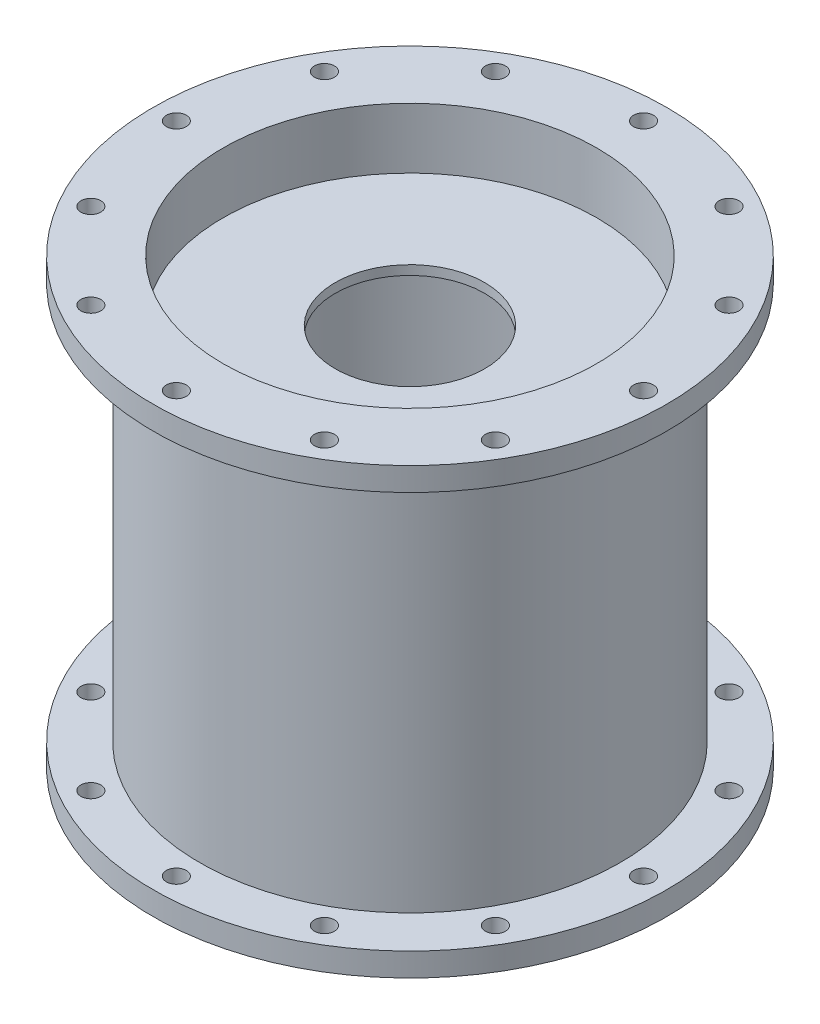
ISO-10303-21;
HEADER;
FILE_DESCRIPTION(('STEP AP214'),'2;1');
FILE_NAME('part.step','',(''),(''),'','','');
FILE_SCHEMA(('AUTOMOTIVE_DESIGN { 1 0 10303 214 1 1 1 1 }'));
ENDSEC;
DATA;
#1=APPLICATION_CONTEXT('core data for automotive mechanical design processes');
#2=APPLICATION_PROTOCOL_DEFINITION('international standard','automotive_design',2000,#1);
#3=PRODUCT_CONTEXT('',#1,'mechanical');
#4=PRODUCT('Part','Part','',(#3));
#5=PRODUCT_RELATED_PRODUCT_CATEGORY('part','',(#4));
#6=PRODUCT_DEFINITION_FORMATION('','',#4);
#7=PRODUCT_DEFINITION_CONTEXT('part definition',#1,'design');
#8=PRODUCT_DEFINITION('design','',#6,#7);
#9=PRODUCT_DEFINITION_SHAPE('','',#8);
#10=(LENGTH_UNIT() NAMED_UNIT(*) SI_UNIT(.MILLI.,.METRE.));
#11=(NAMED_UNIT(*) PLANE_ANGLE_UNIT() SI_UNIT($,.RADIAN.));
#12=(NAMED_UNIT(*) SI_UNIT($,.STERADIAN.) SOLID_ANGLE_UNIT());
#13=UNCERTAINTY_MEASURE_WITH_UNIT(LENGTH_MEASURE(1.E-05),#10,'distance_accuracy_value','');
#14=(GEOMETRIC_REPRESENTATION_CONTEXT(3) GLOBAL_UNCERTAINTY_ASSIGNED_CONTEXT((#13)) GLOBAL_UNIT_ASSIGNED_CONTEXT((#10,
#11,#12)) REPRESENTATION_CONTEXT('',''));
#15=CARTESIAN_POINT('',(0.,0.,0.));
#16=DIRECTION('',(0.,0.,1.));
#17=DIRECTION('',(1.,0.,0.));
#18=AXIS2_PLACEMENT_3D('',#15,#16,#17);
#19=CARTESIAN_POINT('',(0.,0.,0.));
#20=DIRECTION('',(0.,-1.,0.));
#21=DIRECTION('',(0.,0.,-1.));
#22=AXIS2_PLACEMENT_3D('',#19,#20,#21);
#23=CYLINDRICAL_SURFACE('',#22,50.8);
#24=CARTESIAN_POINT('',(0.,101.661657822041,0.));
#25=DIRECTION('',(0.,-1.,0.));
#26=DIRECTION('',(0.,0.,-1.));
#27=AXIS2_PLACEMENT_3D('',#24,#25,#26);
#28=CIRCLE('',#27,50.8);
#29=CARTESIAN_POINT('',(0.,101.661657822041,-50.8));
#30=VERTEX_POINT('',#29);
#31=EDGE_CURVE('E10',#30,#30,#28,.T.);
#32=ORIENTED_EDGE('',*,*,#31,.F.);
#33=EDGE_LOOP('',(#32));
#34=FACE_BOUND('',#33,.T.);
#35=CARTESIAN_POINT('',(0.,18.9883421779588,0.));
#36=DIRECTION('',(0.,1.,0.));
#37=DIRECTION('',(0.,0.,1.));
#38=AXIS2_PLACEMENT_3D('',#35,#36,#37);
#39=CIRCLE('',#38,50.8);
#40=CARTESIAN_POINT('',(0.,18.9883421779588,50.8));
#41=VERTEX_POINT('',#40);
#42=EDGE_CURVE('E58',#41,#41,#39,.T.);
#43=ORIENTED_EDGE('',*,*,#42,.F.);
#44=EDGE_LOOP('',(#43));
#45=FACE_BOUND('',#44,.T.);
#46=ADVANCED_FACE('F43',(#34,#45),#23,.F.);
#47=CARTESIAN_POINT('',(0.,104.201657822041,0.));
#48=DIRECTION('',(0.,1.,0.));
#49=DIRECTION('',(0.,0.,1.));
#50=AXIS2_PLACEMENT_3D('',#47,#48,#49);
#51=CIRCLE('',#50,50.8);
#52=CARTESIAN_POINT('',(0.,104.201657822041,50.8));
#53=VERTEX_POINT('',#52);
#54=EDGE_CURVE('E52',#53,#53,#51,.T.);
#55=ORIENTED_EDGE('',*,*,#54,.F.);
#56=EDGE_LOOP('',(#55));
#57=FACE_BOUND('',#56,.T.);
#58=CARTESIAN_POINT('',(0.,120.65,0.));
#59=DIRECTION('',(0.,-1.,0.));
#60=DIRECTION('',(0.,0.,-1.));
#61=AXIS2_PLACEMENT_3D('',#58,#59,#60);
#62=CIRCLE('',#61,50.8);
#63=CARTESIAN_POINT('',(0.,120.65,-50.8));
#64=VERTEX_POINT('',#63);
#65=EDGE_CURVE('E167',#64,#64,#62,.T.);
#66=ORIENTED_EDGE('',*,*,#65,.F.);
#67=EDGE_LOOP('',(#66));
#68=FACE_BOUND('',#67,.T.);
#69=ADVANCED_FACE('F205',(#57,#68),#23,.F.);
#70=CARTESIAN_POINT('',(0.,0.,-57.15));
#71=DIRECTION('',(0.,-1.,0.));
#72=DIRECTION('',(0.,0.,-1.));
#73=AXIS2_PLACEMENT_3D('',#70,#71,#72);
#74=PLANE('',#73);
#75=CARTESIAN_POINT('',(-63.5,0.,0.));
#76=DIRECTION('',(0.,1.,0.));
#77=DIRECTION('',(0.,0.,1.));
#78=AXIS2_PLACEMENT_3D('',#75,#76,#77);
#79=CIRCLE('',#78,2.70509999999999);
#80=CARTESIAN_POINT('',(-63.5,0.,2.70509999999998));
#81=VERTEX_POINT('',#80);
#82=EDGE_CURVE('E244',#81,#81,#79,.T.);
#83=ORIENTED_EDGE('',*,*,#82,.T.);
#84=EDGE_LOOP('',(#83));
#85=FACE_BOUND('',#84,.T.);
#86=CARTESIAN_POINT('',(-54.9926131403119,0.,-31.75));
#87=DIRECTION('',(0.,1.,0.));
#88=DIRECTION('',(0.,0.,1.));
#89=AXIS2_PLACEMENT_3D('',#86,#87,#88);
#90=CIRCLE('',#89,2.70509999999999);
#91=CARTESIAN_POINT('',(-54.9926131403119,0.,-29.0449));
#92=VERTEX_POINT('',#91);
#93=EDGE_CURVE('E248',#92,#92,#90,.T.);
#94=ORIENTED_EDGE('',*,*,#93,.T.);
#95=EDGE_LOOP('',(#94));
#96=FACE_BOUND('',#95,.T.);
#97=CARTESIAN_POINT('',(-31.75,0.,-54.9926131403119));
#98=DIRECTION('',(0.,1.,0.));
#99=DIRECTION('',(0.,0.,1.));
#100=AXIS2_PLACEMENT_3D('',#97,#98,#99);
#101=CIRCLE('',#100,2.70509999999998);
#102=CARTESIAN_POINT('',(-31.75,0.,-52.2875131403119));
#103=VERTEX_POINT('',#102);
#104=EDGE_CURVE('E252',#103,#103,#101,.T.);
#105=ORIENTED_EDGE('',*,*,#104,.T.);
#106=EDGE_LOOP('',(#105));
#107=FACE_BOUND('',#106,.T.);
#108=CARTESIAN_POINT('',(0.,0.,-63.5));
#109=DIRECTION('',(0.,1.,0.));
#110=DIRECTION('',(0.,0.,1.));
#111=AXIS2_PLACEMENT_3D('',#108,#109,#110);
#112=CIRCLE('',#111,2.70509999999999);
#113=CARTESIAN_POINT('',(0.,0.,-60.7949));
#114=VERTEX_POINT('',#113);
#115=EDGE_CURVE('E256',#114,#114,#112,.T.);
#116=ORIENTED_EDGE('',*,*,#115,.T.);
#117=EDGE_LOOP('',(#116));
#118=FACE_BOUND('',#117,.T.);
#119=CARTESIAN_POINT('',(31.75,0.,-54.9926131403119));
#120=DIRECTION('',(0.,1.,0.));
#121=DIRECTION('',(0.,0.,1.));
#122=AXIS2_PLACEMENT_3D('',#119,#120,#121);
#123=CIRCLE('',#122,2.70509999999999);
#124=CARTESIAN_POINT('',(31.75,0.,-52.2875131403119));
#125=VERTEX_POINT('',#124);
#126=EDGE_CURVE('E260',#125,#125,#123,.T.);
#127=ORIENTED_EDGE('',*,*,#126,.T.);
#128=EDGE_LOOP('',(#127));
#129=FACE_BOUND('',#128,.T.);
#130=CARTESIAN_POINT('',(54.9926131403119,0.,-31.75));
#131=DIRECTION('',(0.,1.,0.));
#132=DIRECTION('',(0.,0.,1.));
#133=AXIS2_PLACEMENT_3D('',#130,#131,#132);
#134=CIRCLE('',#133,2.70509999999999);
#135=CARTESIAN_POINT('',(54.9926131403119,0.,-29.0449));
#136=VERTEX_POINT('',#135);
#137=EDGE_CURVE('E264',#136,#136,#134,.T.);
#138=ORIENTED_EDGE('',*,*,#137,.T.);
#139=EDGE_LOOP('',(#138));
#140=FACE_BOUND('',#139,.T.);
#141=CARTESIAN_POINT('',(63.5,0.,0.));
#142=DIRECTION('',(0.,1.,0.));
#143=DIRECTION('',(0.,0.,1.));
#144=AXIS2_PLACEMENT_3D('',#141,#142,#143);
#145=CIRCLE('',#144,2.70509999999999);
#146=CARTESIAN_POINT('',(63.5,0.,2.70509999999999));
#147=VERTEX_POINT('',#146);
#148=EDGE_CURVE('E267',#147,#147,#145,.T.);
#149=ORIENTED_EDGE('',*,*,#148,.T.);
#150=EDGE_LOOP('',(#149));
#151=FACE_BOUND('',#150,.T.);
#152=CARTESIAN_POINT('',(54.9926131403119,0.,31.75));
#153=DIRECTION('',(0.,1.,0.));
#154=DIRECTION('',(0.,0.,1.));
#155=AXIS2_PLACEMENT_3D('',#152,#153,#154);
#156=CIRCLE('',#155,2.70509999999999);
#157=CARTESIAN_POINT('',(54.9926131403119,0.,34.4551));
#158=VERTEX_POINT('',#157);
#159=EDGE_CURVE('E77',#158,#158,#156,.T.);
#160=ORIENTED_EDGE('',*,*,#159,.T.);
#161=EDGE_LOOP('',(#160));
#162=FACE_BOUND('',#161,.T.);
#163=CARTESIAN_POINT('',(31.75,0.,54.9926131403119));
#164=DIRECTION('',(0.,1.,0.));
#165=DIRECTION('',(0.,0.,1.));
#166=AXIS2_PLACEMENT_3D('',#163,#164,#165);
#167=CIRCLE('',#166,2.70509999999999);
#168=CARTESIAN_POINT('',(31.75,0.,57.6977131403118));
#169=VERTEX_POINT('',#168);
#170=EDGE_CURVE('E99',#169,#169,#167,.T.);
#171=ORIENTED_EDGE('',*,*,#170,.T.);
#172=EDGE_LOOP('',(#171));
#173=FACE_BOUND('',#172,.T.);
#174=CARTESIAN_POINT('',(0.,0.,63.5));
#175=DIRECTION('',(0.,1.,0.));
#176=DIRECTION('',(0.,0.,1.));
#177=AXIS2_PLACEMENT_3D('',#174,#175,#176);
#178=CIRCLE('',#177,2.70509999999999);
#179=CARTESIAN_POINT('',(0.,0.,66.2051));
#180=VERTEX_POINT('',#179);
#181=EDGE_CURVE('E115',#180,#180,#178,.T.);
#182=ORIENTED_EDGE('',*,*,#181,.T.);
#183=EDGE_LOOP('',(#182));
#184=FACE_BOUND('',#183,.T.);
#185=CARTESIAN_POINT('',(-31.75,0.,54.9926131403119));
#186=DIRECTION('',(0.,1.,0.));
#187=DIRECTION('',(0.,0.,1.));
#188=AXIS2_PLACEMENT_3D('',#185,#186,#187);
#189=CIRCLE('',#188,2.70509999999998);
#190=CARTESIAN_POINT('',(-31.75,0.,57.6977131403119));
#191=VERTEX_POINT('',#190);
#192=EDGE_CURVE('E72',#191,#191,#189,.T.);
#193=ORIENTED_EDGE('',*,*,#192,.T.);
#194=EDGE_LOOP('',(#193));
#195=FACE_BOUND('',#194,.T.);
#196=CARTESIAN_POINT('',(-54.9926131403119,0.,31.75));
#197=DIRECTION('',(0.,1.,0.));
#198=DIRECTION('',(0.,0.,1.));
#199=AXIS2_PLACEMENT_3D('',#196,#197,#198);
#200=CIRCLE('',#199,2.70509999999999);
#201=CARTESIAN_POINT('',(-54.9926131403119,0.,34.4551));
#202=VERTEX_POINT('',#201);
#203=EDGE_CURVE('E67',#202,#202,#200,.T.);
#204=ORIENTED_EDGE('',*,*,#203,.T.);
#205=EDGE_LOOP('',(#204));
#206=FACE_BOUND('',#205,.T.);
#207=CARTESIAN_POINT('',(0.,0.,0.));
#208=DIRECTION('',(0.,-1.,0.));
#209=DIRECTION('',(0.,0.,-1.));
#210=AXIS2_PLACEMENT_3D('',#207,#208,#209);
#211=CIRCLE('',#210,69.85);
#212=CARTESIAN_POINT('',(0.,0.,-69.85));
#213=VERTEX_POINT('',#212);
#214=EDGE_CURVE('E191',#213,#213,#211,.T.);
#215=ORIENTED_EDGE('',*,*,#214,.T.);
#216=EDGE_LOOP('',(#215));
#217=FACE_BOUND('',#216,.T.);
#218=CARTESIAN_POINT('',(0.,0.,0.));
#219=DIRECTION('',(0.,-1.,0.));
#220=DIRECTION('',(0.,0.,-1.));
#221=AXIS2_PLACEMENT_3D('',#218,#219,#220);
#222=CIRCLE('',#221,50.8);
#223=CARTESIAN_POINT('',(0.,0.,-50.8));
#224=VERTEX_POINT('',#223);
#225=EDGE_CURVE('E163',#224,#224,#222,.T.);
#226=ORIENTED_EDGE('',*,*,#225,.F.);
#227=EDGE_LOOP('',(#226));
#228=FACE_BOUND('',#227,.T.);
#229=ADVANCED_FACE('F45',(#85,#96,#107,#118,#129,#140,#151,#162,#173,#184,#195,#206,#217,#228),
#74,.T.);
#230=CARTESIAN_POINT('',(0.,0.,0.));
#231=DIRECTION('',(0.,-1.,0.));
#232=DIRECTION('',(0.,0.,-1.));
#233=AXIS2_PLACEMENT_3D('',#230,#231,#232);
#234=CYLINDRICAL_SURFACE('',#233,69.85);
#235=CARTESIAN_POINT('',(0.,6.35,0.));
#236=DIRECTION('',(0.,-1.,0.));
#237=DIRECTION('',(0.,0.,-1.));
#238=AXIS2_PLACEMENT_3D('',#235,#236,#237);
#239=CIRCLE('',#238,69.85);
#240=CARTESIAN_POINT('',(0.,6.35,-69.85));
#241=VERTEX_POINT('',#240);
#242=EDGE_CURVE('E187',#241,#241,#239,.T.);
#243=ORIENTED_EDGE('',*,*,#242,.T.);
#244=EDGE_LOOP('',(#243));
#245=FACE_BOUND('',#244,.T.);
#246=ORIENTED_EDGE('',*,*,#214,.F.);
#247=EDGE_LOOP('',(#246));
#248=FACE_BOUND('',#247,.T.);
#249=ADVANCED_FACE('F232',(#245,#248),#234,.T.);
#250=CARTESIAN_POINT('',(0.,6.35,-69.85));
#251=DIRECTION('',(0.,1.,0.));
#252=DIRECTION('',(0.,0.,1.));
#253=AXIS2_PLACEMENT_3D('',#250,#251,#252);
#254=PLANE('',#253);
#255=CARTESIAN_POINT('',(-63.5,6.34999999999999,0.));
#256=DIRECTION('',(0.,1.,0.));
#257=DIRECTION('',(0.,0.,1.));
#258=AXIS2_PLACEMENT_3D('',#255,#256,#257);
#259=CIRCLE('',#258,2.70509999999999);
#260=CARTESIAN_POINT('',(-63.5,6.34999999999999,2.70509999999998));
#261=VERTEX_POINT('',#260);
#262=EDGE_CURVE('E559',#261,#261,#259,.T.);
#263=ORIENTED_EDGE('',*,*,#262,.F.);
#264=EDGE_LOOP('',(#263));
#265=FACE_BOUND('',#264,.T.);
#266=CARTESIAN_POINT('',(-54.9926131403119,6.34999999999999,-31.75));
#267=DIRECTION('',(0.,1.,0.));
#268=DIRECTION('',(0.,0.,1.));
#269=AXIS2_PLACEMENT_3D('',#266,#267,#268);
#270=CIRCLE('',#269,2.70509999999999);
#271=CARTESIAN_POINT('',(-54.9926131403119,6.34999999999999,-29.0449));
#272=VERTEX_POINT('',#271);
#273=EDGE_CURVE('E583',#272,#272,#270,.T.);
#274=ORIENTED_EDGE('',*,*,#273,.F.);
#275=EDGE_LOOP('',(#274));
#276=FACE_BOUND('',#275,.T.);
#277=CARTESIAN_POINT('',(-31.75,6.34999999999999,-54.9926131403119));
#278=DIRECTION('',(0.,1.,0.));
#279=DIRECTION('',(0.,0.,1.));
#280=AXIS2_PLACEMENT_3D('',#277,#278,#279);
#281=CIRCLE('',#280,2.70509999999999);
#282=CARTESIAN_POINT('',(-31.75,6.34999999999999,-52.2875131403119));
#283=VERTEX_POINT('',#282);
#284=EDGE_CURVE('E597',#283,#283,#281,.T.);
#285=ORIENTED_EDGE('',*,*,#284,.F.);
#286=EDGE_LOOP('',(#285));
#287=FACE_BOUND('',#286,.T.);
#288=CARTESIAN_POINT('',(0.,6.34999999999999,-63.5));
#289=DIRECTION('',(0.,1.,0.));
#290=DIRECTION('',(0.,0.,1.));
#291=AXIS2_PLACEMENT_3D('',#288,#289,#290);
#292=CIRCLE('',#291,2.70509999999999);
#293=CARTESIAN_POINT('',(0.,6.34999999999999,-60.7949));
#294=VERTEX_POINT('',#293);
#295=EDGE_CURVE('E607',#294,#294,#292,.T.);
#296=ORIENTED_EDGE('',*,*,#295,.F.);
#297=EDGE_LOOP('',(#296));
#298=FACE_BOUND('',#297,.T.);
#299=CARTESIAN_POINT('',(31.75,6.34999999999999,-54.9926131403119));
#300=DIRECTION('',(0.,1.,0.));
#301=DIRECTION('',(0.,0.,1.));
#302=AXIS2_PLACEMENT_3D('',#299,#300,#301);
#303=CIRCLE('',#302,2.70509999999999);
#304=CARTESIAN_POINT('',(31.75,6.34999999999999,-52.2875131403119));
#305=VERTEX_POINT('',#304);
#306=EDGE_CURVE('E621',#305,#305,#303,.T.);
#307=ORIENTED_EDGE('',*,*,#306,.F.);
#308=EDGE_LOOP('',(#307));
#309=FACE_BOUND('',#308,.T.);
#310=CARTESIAN_POINT('',(54.9926131403119,6.34999999999999,-31.75));
#311=DIRECTION('',(0.,1.,0.));
#312=DIRECTION('',(0.,0.,1.));
#313=AXIS2_PLACEMENT_3D('',#310,#311,#312);
#314=CIRCLE('',#313,2.70509999999999);
#315=CARTESIAN_POINT('',(54.9926131403119,6.34999999999999,-29.0449));
#316=VERTEX_POINT('',#315);
#317=EDGE_CURVE('E635',#316,#316,#314,.T.);
#318=ORIENTED_EDGE('',*,*,#317,.F.);
#319=EDGE_LOOP('',(#318));
#320=FACE_BOUND('',#319,.T.);
#321=CARTESIAN_POINT('',(63.5,6.34999999999999,0.));
#322=DIRECTION('',(0.,1.,0.));
#323=DIRECTION('',(0.,0.,1.));
#324=AXIS2_PLACEMENT_3D('',#321,#322,#323);
#325=CIRCLE('',#324,2.70509999999999);
#326=CARTESIAN_POINT('',(63.5,6.34999999999999,2.70509999999999));
#327=VERTEX_POINT('',#326);
#328=EDGE_CURVE('E92',#327,#327,#325,.T.);
#329=ORIENTED_EDGE('',*,*,#328,.F.);
#330=EDGE_LOOP('',(#329));
#331=FACE_BOUND('',#330,.T.);
#332=CARTESIAN_POINT('',(54.9926131403119,6.34999999999999,31.75));
#333=DIRECTION('',(0.,1.,0.));
#334=DIRECTION('',(0.,0.,1.));
#335=AXIS2_PLACEMENT_3D('',#332,#333,#334);
#336=CIRCLE('',#335,2.70509999999999);
#337=CARTESIAN_POINT('',(54.9926131403119,6.34999999999999,34.4551));
#338=VERTEX_POINT('',#337);
#339=EDGE_CURVE('E73',#338,#338,#336,.T.);
#340=ORIENTED_EDGE('',*,*,#339,.F.);
#341=EDGE_LOOP('',(#340));
#342=FACE_BOUND('',#341,.T.);
#343=CARTESIAN_POINT('',(31.75,6.34999999999999,54.9926131403119));
#344=DIRECTION('',(0.,1.,0.));
#345=DIRECTION('',(0.,0.,1.));
#346=AXIS2_PLACEMENT_3D('',#343,#344,#345);
#347=CIRCLE('',#346,2.70509999999999);
#348=CARTESIAN_POINT('',(31.75,6.34999999999999,57.6977131403118));
#349=VERTEX_POINT('',#348);
#350=EDGE_CURVE('E107',#349,#349,#347,.T.);
#351=ORIENTED_EDGE('',*,*,#350,.F.);
#352=EDGE_LOOP('',(#351));
#353=FACE_BOUND('',#352,.T.);
#354=CARTESIAN_POINT('',(0.,6.34999999999999,63.5));
#355=DIRECTION('',(0.,1.,0.));
#356=DIRECTION('',(0.,0.,1.));
#357=AXIS2_PLACEMENT_3D('',#354,#355,#356);
#358=CIRCLE('',#357,2.70509999999999);
#359=CARTESIAN_POINT('',(0.,6.34999999999999,66.2051));
#360=VERTEX_POINT('',#359);
#361=EDGE_CURVE('E123',#360,#360,#358,.T.);
#362=ORIENTED_EDGE('',*,*,#361,.F.);
#363=EDGE_LOOP('',(#362));
#364=FACE_BOUND('',#363,.T.);
#365=CARTESIAN_POINT('',(-31.75,6.34999999999999,54.9926131403119));
#366=DIRECTION('',(0.,1.,0.));
#367=DIRECTION('',(0.,0.,1.));
#368=AXIS2_PLACEMENT_3D('',#365,#366,#367);
#369=CIRCLE('',#368,2.70509999999999);
#370=CARTESIAN_POINT('',(-31.75,6.34999999999999,57.6977131403119));
#371=VERTEX_POINT('',#370);
#372=EDGE_CURVE('E71',#371,#371,#369,.T.);
#373=ORIENTED_EDGE('',*,*,#372,.F.);
#374=EDGE_LOOP('',(#373));
#375=FACE_BOUND('',#374,.T.);
#376=CARTESIAN_POINT('',(-54.9926131403119,6.34999999999999,31.75));
#377=DIRECTION('',(0.,1.,0.));
#378=DIRECTION('',(0.,0.,1.));
#379=AXIS2_PLACEMENT_3D('',#376,#377,#378);
#380=CIRCLE('',#379,2.70509999999999);
#381=CARTESIAN_POINT('',(-54.9926131403119,6.34999999999999,34.4551));
#382=VERTEX_POINT('',#381);
#383=EDGE_CURVE('E62',#382,#382,#380,.T.);
#384=ORIENTED_EDGE('',*,*,#383,.F.);
#385=EDGE_LOOP('',(#384));
#386=FACE_BOUND('',#385,.T.);
#387=CARTESIAN_POINT('',(0.,6.35,0.));
#388=DIRECTION('',(0.,-1.,0.));
#389=DIRECTION('',(0.,0.,-1.));
#390=AXIS2_PLACEMENT_3D('',#387,#388,#389);
#391=CIRCLE('',#390,57.15);
#392=CARTESIAN_POINT('',(0.,6.35,-57.15));
#393=VERTEX_POINT('',#392);
#394=EDGE_CURVE('E183',#393,#393,#391,.T.);
#395=ORIENTED_EDGE('',*,*,#394,.T.);
#396=EDGE_LOOP('',(#395));
#397=FACE_BOUND('',#396,.T.);
#398=ORIENTED_EDGE('',*,*,#242,.F.);
#399=EDGE_LOOP('',(#398));
#400=FACE_BOUND('',#399,.T.);
#401=ADVANCED_FACE('F239',(#265,#276,#287,#298,#309,#320,#331,#342,#353,#364,#375,#386,#397,
#400),#254,.T.);
#402=CARTESIAN_POINT('',(0.,0.,0.));
#403=DIRECTION('',(0.,-1.,0.));
#404=DIRECTION('',(0.,0.,-1.));
#405=AXIS2_PLACEMENT_3D('',#402,#403,#404);
#406=CYLINDRICAL_SURFACE('',#405,57.15);
#407=CARTESIAN_POINT('',(0.,114.3,0.));
#408=DIRECTION('',(0.,-1.,0.));
#409=DIRECTION('',(0.,0.,-1.));
#410=AXIS2_PLACEMENT_3D('',#407,#408,#409);
#411=CIRCLE('',#410,57.15);
#412=CARTESIAN_POINT('',(0.,114.3,-57.15));
#413=VERTEX_POINT('',#412);
#414=EDGE_CURVE('E179',#413,#413,#411,.T.);
#415=ORIENTED_EDGE('',*,*,#414,.T.);
#416=EDGE_LOOP('',(#415));
#417=FACE_BOUND('',#416,.T.);
#418=ORIENTED_EDGE('',*,*,#394,.F.);
#419=EDGE_LOOP('',(#418));
#420=FACE_BOUND('',#419,.T.);
#421=ADVANCED_FACE('F659',(#417,#420),#406,.T.);
#422=CARTESIAN_POINT('',(0.,114.3,-69.85));
#423=DIRECTION('',(0.,-1.,0.));
#424=DIRECTION('',(0.,0.,-1.));
#425=AXIS2_PLACEMENT_3D('',#422,#423,#424);
#426=PLANE('',#425);
#427=CARTESIAN_POINT('',(-63.5,114.3,0.));
#428=DIRECTION('',(0.,-1.,0.));
#429=DIRECTION('',(0.,0.,-1.));
#430=AXIS2_PLACEMENT_3D('',#427,#428,#429);
#431=CIRCLE('',#430,2.70509999999999);
#432=CARTESIAN_POINT('',(-63.5,114.3,-2.70509999999999));
#433=VERTEX_POINT('',#432);
#434=EDGE_CURVE('E561',#433,#433,#431,.T.);
#435=ORIENTED_EDGE('',*,*,#434,.F.);
#436=EDGE_LOOP('',(#435));
#437=FACE_BOUND('',#436,.T.);
#438=CARTESIAN_POINT('',(-54.9926131403119,114.3,-31.75));
#439=DIRECTION('',(0.,-1.,0.));
#440=DIRECTION('',(0.,0.,-1.));
#441=AXIS2_PLACEMENT_3D('',#438,#439,#440);
#442=CIRCLE('',#441,2.70509999999999);
#443=CARTESIAN_POINT('',(-54.9926131403119,114.3,-34.4551));
#444=VERTEX_POINT('',#443);
#445=EDGE_CURVE('E579',#444,#444,#442,.T.);
#446=ORIENTED_EDGE('',*,*,#445,.F.);
#447=EDGE_LOOP('',(#446));
#448=FACE_BOUND('',#447,.T.);
#449=CARTESIAN_POINT('',(-31.75,114.3,-54.9926131403119));
#450=DIRECTION('',(0.,-1.,0.));
#451=DIRECTION('',(0.,0.,-1.));
#452=AXIS2_PLACEMENT_3D('',#449,#450,#451);
#453=CIRCLE('',#452,2.70509999999999);
#454=CARTESIAN_POINT('',(-31.75,114.3,-57.6977131403119));
#455=VERTEX_POINT('',#454);
#456=EDGE_CURVE('E593',#455,#455,#453,.T.);
#457=ORIENTED_EDGE('',*,*,#456,.F.);
#458=EDGE_LOOP('',(#457));
#459=FACE_BOUND('',#458,.T.);
#460=CARTESIAN_POINT('',(0.,114.3,-63.5));
#461=DIRECTION('',(0.,-1.,0.));
#462=DIRECTION('',(0.,0.,-1.));
#463=AXIS2_PLACEMENT_3D('',#460,#461,#462);
#464=CIRCLE('',#463,2.70509999999999);
#465=CARTESIAN_POINT('',(0.,114.3,-66.2051));
#466=VERTEX_POINT('',#465);
#467=EDGE_CURVE('E611',#466,#466,#464,.T.);
#468=ORIENTED_EDGE('',*,*,#467,.F.);
#469=EDGE_LOOP('',(#468));
#470=FACE_BOUND('',#469,.T.);
#471=CARTESIAN_POINT('',(31.75,114.3,-54.9926131403119));
#472=DIRECTION('',(0.,-1.,0.));
#473=DIRECTION('',(0.,0.,-1.));
#474=AXIS2_PLACEMENT_3D('',#471,#472,#473);
#475=CIRCLE('',#474,2.70509999999999);
#476=CARTESIAN_POINT('',(31.75,114.3,-57.6977131403119));
#477=VERTEX_POINT('',#476);
#478=EDGE_CURVE('E625',#477,#477,#475,.T.);
#479=ORIENTED_EDGE('',*,*,#478,.F.);
#480=EDGE_LOOP('',(#479));
#481=FACE_BOUND('',#480,.T.);
#482=CARTESIAN_POINT('',(54.9926131403119,114.3,-31.75));
#483=DIRECTION('',(0.,-1.,0.));
#484=DIRECTION('',(0.,0.,-1.));
#485=AXIS2_PLACEMENT_3D('',#482,#483,#484);
#486=CIRCLE('',#485,2.70509999999999);
#487=CARTESIAN_POINT('',(54.9926131403119,114.3,-34.4551));
#488=VERTEX_POINT('',#487);
#489=EDGE_CURVE('E639',#488,#488,#486,.T.);
#490=ORIENTED_EDGE('',*,*,#489,.F.);
#491=EDGE_LOOP('',(#490));
#492=FACE_BOUND('',#491,.T.);
#493=CARTESIAN_POINT('',(63.5,114.3,0.));
#494=DIRECTION('',(0.,-1.,0.));
#495=DIRECTION('',(0.,0.,-1.));
#496=AXIS2_PLACEMENT_3D('',#493,#494,#495);
#497=CIRCLE('',#496,2.70509999999999);
#498=CARTESIAN_POINT('',(63.5,114.3,-2.70509999999999));
#499=VERTEX_POINT('',#498);
#500=EDGE_CURVE('E47',#499,#499,#497,.T.);
#501=ORIENTED_EDGE('',*,*,#500,.F.);
#502=EDGE_LOOP('',(#501));
#503=FACE_BOUND('',#502,.T.);
#504=CARTESIAN_POINT('',(54.9926131403119,114.3,31.75));
#505=DIRECTION('',(0.,-1.,0.));
#506=DIRECTION('',(0.,0.,-1.));
#507=AXIS2_PLACEMENT_3D('',#504,#505,#506);
#508=CIRCLE('',#507,2.70509999999999);
#509=CARTESIAN_POINT('',(54.9926131403119,114.3,29.0449));
#510=VERTEX_POINT('',#509);
#511=EDGE_CURVE('E76',#510,#510,#508,.T.);
#512=ORIENTED_EDGE('',*,*,#511,.F.);
#513=EDGE_LOOP('',(#512));
#514=FACE_BOUND('',#513,.T.);
#515=CARTESIAN_POINT('',(31.75,114.3,54.9926131403119));
#516=DIRECTION('',(0.,-1.,0.));
#517=DIRECTION('',(0.,0.,-1.));
#518=AXIS2_PLACEMENT_3D('',#515,#516,#517);
#519=CIRCLE('',#518,2.70509999999999);
#520=CARTESIAN_POINT('',(31.75,114.3,52.2875131403119));
#521=VERTEX_POINT('',#520);
#522=EDGE_CURVE('E103',#521,#521,#519,.T.);
#523=ORIENTED_EDGE('',*,*,#522,.F.);
#524=EDGE_LOOP('',(#523));
#525=FACE_BOUND('',#524,.T.);
#526=CARTESIAN_POINT('',(0.,114.3,63.5));
#527=DIRECTION('',(0.,-1.,0.));
#528=DIRECTION('',(0.,0.,-1.));
#529=AXIS2_PLACEMENT_3D('',#526,#527,#528);
#530=CIRCLE('',#529,2.70509999999999);
#531=CARTESIAN_POINT('',(0.,114.3,60.7949));
#532=VERTEX_POINT('',#531);
#533=EDGE_CURVE('E119',#532,#532,#530,.T.);
#534=ORIENTED_EDGE('',*,*,#533,.F.);
#535=EDGE_LOOP('',(#534));
#536=FACE_BOUND('',#535,.T.);
#537=CARTESIAN_POINT('',(-31.75,114.3,54.9926131403119));
#538=DIRECTION('',(0.,-1.,0.));
#539=DIRECTION('',(0.,0.,-1.));
#540=AXIS2_PLACEMENT_3D('',#537,#538,#539);
#541=CIRCLE('',#540,2.70509999999999);
#542=CARTESIAN_POINT('',(-31.75,114.3,52.2875131403119));
#543=VERTEX_POINT('',#542);
#544=EDGE_CURVE('E68',#543,#543,#541,.T.);
#545=ORIENTED_EDGE('',*,*,#544,.F.);
#546=EDGE_LOOP('',(#545));
#547=FACE_BOUND('',#546,.T.);
#548=CARTESIAN_POINT('',(-54.9926131403119,114.3,31.75));
#549=DIRECTION('',(0.,-1.,0.));
#550=DIRECTION('',(0.,0.,-1.));
#551=AXIS2_PLACEMENT_3D('',#548,#549,#550);
#552=CIRCLE('',#551,2.70509999999999);
#553=CARTESIAN_POINT('',(-54.9926131403119,114.3,29.0449));
#554=VERTEX_POINT('',#553);
#555=EDGE_CURVE('E66',#554,#554,#552,.T.);
#556=ORIENTED_EDGE('',*,*,#555,.F.);
#557=EDGE_LOOP('',(#556));
#558=FACE_BOUND('',#557,.T.);
#559=CARTESIAN_POINT('',(0.,114.3,0.));
#560=DIRECTION('',(0.,-1.,0.));
#561=DIRECTION('',(0.,0.,-1.));
#562=AXIS2_PLACEMENT_3D('',#559,#560,#561);
#563=CIRCLE('',#562,69.85);
#564=CARTESIAN_POINT('',(0.,114.3,-69.85));
#565=VERTEX_POINT('',#564);
#566=EDGE_CURVE('E175',#565,#565,#563,.T.);
#567=ORIENTED_EDGE('',*,*,#566,.T.);
#568=EDGE_LOOP('',(#567));
#569=FACE_BOUND('',#568,.T.);
#570=ORIENTED_EDGE('',*,*,#414,.F.);
#571=EDGE_LOOP('',(#570));
#572=FACE_BOUND('',#571,.T.);
#573=ADVANCED_FACE('F656',(#437,#448,#459,#470,#481,#492,#503,#514,#525,#536,#547,#558,#569,
#572),#426,.T.);
#574=CARTESIAN_POINT('',(0.,0.,0.));
#575=DIRECTION('',(0.,-1.,0.));
#576=DIRECTION('',(0.,0.,-1.));
#577=AXIS2_PLACEMENT_3D('',#574,#575,#576);
#578=CYLINDRICAL_SURFACE('',#577,69.85);
#579=CARTESIAN_POINT('',(0.,120.65,0.));
#580=DIRECTION('',(0.,-1.,0.));
#581=DIRECTION('',(0.,0.,-1.));
#582=AXIS2_PLACEMENT_3D('',#579,#580,#581);
#583=CIRCLE('',#582,69.85);
#584=CARTESIAN_POINT('',(0.,120.65,-69.85));
#585=VERTEX_POINT('',#584);
#586=EDGE_CURVE('E171',#585,#585,#583,.T.);
#587=ORIENTED_EDGE('',*,*,#586,.T.);
#588=EDGE_LOOP('',(#587));
#589=FACE_BOUND('',#588,.T.);
#590=ORIENTED_EDGE('',*,*,#566,.F.);
#591=EDGE_LOOP('',(#590));
#592=FACE_BOUND('',#591,.T.);
#593=ADVANCED_FACE('F225',(#589,#592),#578,.T.);
#594=CARTESIAN_POINT('',(0.,120.65,-50.8));
#595=DIRECTION('',(0.,1.,0.));
#596=DIRECTION('',(0.,0.,1.));
#597=AXIS2_PLACEMENT_3D('',#594,#595,#596);
#598=PLANE('',#597);
#599=CARTESIAN_POINT('',(-63.5,120.65,0.));
#600=DIRECTION('',(0.,1.,0.));
#601=DIRECTION('',(0.,0.,1.));
#602=AXIS2_PLACEMENT_3D('',#599,#600,#601);
#603=CIRCLE('',#602,2.70509999999999);
#604=CARTESIAN_POINT('',(-63.5,120.65,2.70509999999998));
#605=VERTEX_POINT('',#604);
#606=EDGE_CURVE('E562',#605,#605,#603,.T.);
#607=ORIENTED_EDGE('',*,*,#606,.F.);
#608=EDGE_LOOP('',(#607));
#609=FACE_BOUND('',#608,.T.);
#610=CARTESIAN_POINT('',(-54.9926131403119,120.65,-31.75));
#611=DIRECTION('',(0.,1.,0.));
#612=DIRECTION('',(0.,0.,1.));
#613=AXIS2_PLACEMENT_3D('',#610,#611,#612);
#614=CIRCLE('',#613,2.70509999999999);
#615=CARTESIAN_POINT('',(-54.9926131403119,120.65,-29.0449));
#616=VERTEX_POINT('',#615);
#617=EDGE_CURVE('E573',#616,#616,#614,.T.);
#618=ORIENTED_EDGE('',*,*,#617,.F.);
#619=EDGE_LOOP('',(#618));
#620=FACE_BOUND('',#619,.T.);
#621=CARTESIAN_POINT('',(-31.75,120.65,-54.9926131403119));
#622=DIRECTION('',(0.,1.,0.));
#623=DIRECTION('',(0.,0.,1.));
#624=AXIS2_PLACEMENT_3D('',#621,#622,#623);
#625=CIRCLE('',#624,2.70509999999999);
#626=CARTESIAN_POINT('',(-31.75,120.65,-52.2875131403119));
#627=VERTEX_POINT('',#626);
#628=EDGE_CURVE('E587',#627,#627,#625,.T.);
#629=ORIENTED_EDGE('',*,*,#628,.F.);
#630=EDGE_LOOP('',(#629));
#631=FACE_BOUND('',#630,.T.);
#632=CARTESIAN_POINT('',(0.,120.65,-63.5));
#633=DIRECTION('',(0.,1.,0.));
#634=DIRECTION('',(0.,0.,1.));
#635=AXIS2_PLACEMENT_3D('',#632,#633,#634);
#636=CIRCLE('',#635,2.70509999999999);
#637=CARTESIAN_POINT('',(0.,120.65,-60.7949));
#638=VERTEX_POINT('',#637);
#639=EDGE_CURVE('E601',#638,#638,#636,.T.);
#640=ORIENTED_EDGE('',*,*,#639,.F.);
#641=EDGE_LOOP('',(#640));
#642=FACE_BOUND('',#641,.T.);
#643=CARTESIAN_POINT('',(31.75,120.65,-54.9926131403119));
#644=DIRECTION('',(0.,1.,0.));
#645=DIRECTION('',(0.,0.,1.));
#646=AXIS2_PLACEMENT_3D('',#643,#644,#645);
#647=CIRCLE('',#646,2.70509999999999);
#648=CARTESIAN_POINT('',(31.75,120.65,-52.2875131403119));
#649=VERTEX_POINT('',#648);
#650=EDGE_CURVE('E615',#649,#649,#647,.T.);
#651=ORIENTED_EDGE('',*,*,#650,.F.);
#652=EDGE_LOOP('',(#651));
#653=FACE_BOUND('',#652,.T.);
#654=CARTESIAN_POINT('',(54.9926131403119,120.65,-31.75));
#655=DIRECTION('',(0.,1.,0.));
#656=DIRECTION('',(0.,0.,1.));
#657=AXIS2_PLACEMENT_3D('',#654,#655,#656);
#658=CIRCLE('',#657,2.70509999999999);
#659=CARTESIAN_POINT('',(54.9926131403119,120.65,-29.0449));
#660=VERTEX_POINT('',#659);
#661=EDGE_CURVE('E629',#660,#660,#658,.T.);
#662=ORIENTED_EDGE('',*,*,#661,.F.);
#663=EDGE_LOOP('',(#662));
#664=FACE_BOUND('',#663,.T.);
#665=CARTESIAN_POINT('',(63.5,120.65,0.));
#666=DIRECTION('',(0.,1.,0.));
#667=DIRECTION('',(0.,0.,1.));
#668=AXIS2_PLACEMENT_3D('',#665,#666,#667);
#669=CIRCLE('',#668,2.70509999999999);
#670=CARTESIAN_POINT('',(63.5,120.65,2.70509999999999));
#671=VERTEX_POINT('',#670);
#672=EDGE_CURVE('E643',#671,#671,#669,.T.);
#673=ORIENTED_EDGE('',*,*,#672,.F.);
#674=EDGE_LOOP('',(#673));
#675=FACE_BOUND('',#674,.T.);
#676=CARTESIAN_POINT('',(54.9926131403119,120.65,31.75));
#677=DIRECTION('',(0.,1.,0.));
#678=DIRECTION('',(0.,0.,1.));
#679=AXIS2_PLACEMENT_3D('',#676,#677,#678);
#680=CIRCLE('',#679,2.70509999999999);
#681=CARTESIAN_POINT('',(54.9926131403119,120.65,34.4551));
#682=VERTEX_POINT('',#681);
#683=EDGE_CURVE('E86',#682,#682,#680,.T.);
#684=ORIENTED_EDGE('',*,*,#683,.F.);
#685=EDGE_LOOP('',(#684));
#686=FACE_BOUND('',#685,.T.);
#687=CARTESIAN_POINT('',(31.75,120.65,54.9926131403119));
#688=DIRECTION('',(0.,1.,0.));
#689=DIRECTION('',(0.,0.,1.));
#690=AXIS2_PLACEMENT_3D('',#687,#688,#689);
#691=CIRCLE('',#690,2.70509999999999);
#692=CARTESIAN_POINT('',(31.75,120.65,57.6977131403118));
#693=VERTEX_POINT('',#692);
#694=EDGE_CURVE('E83',#693,#693,#691,.T.);
#695=ORIENTED_EDGE('',*,*,#694,.F.);
#696=EDGE_LOOP('',(#695));
#697=FACE_BOUND('',#696,.T.);
#698=CARTESIAN_POINT('',(0.,120.65,63.5));
#699=DIRECTION('',(0.,1.,0.));
#700=DIRECTION('',(0.,0.,1.));
#701=AXIS2_PLACEMENT_3D('',#698,#699,#700);
#702=CIRCLE('',#701,2.70509999999999);
#703=CARTESIAN_POINT('',(0.,120.65,66.2051));
#704=VERTEX_POINT('',#703);
#705=EDGE_CURVE('E111',#704,#704,#702,.T.);
#706=ORIENTED_EDGE('',*,*,#705,.F.);
#707=EDGE_LOOP('',(#706));
#708=FACE_BOUND('',#707,.T.);
#709=CARTESIAN_POINT('',(-31.75,120.65,54.9926131403119));
#710=DIRECTION('',(0.,1.,0.));
#711=DIRECTION('',(0.,0.,1.));
#712=AXIS2_PLACEMENT_3D('',#709,#710,#711);
#713=CIRCLE('',#712,2.70509999999999);
#714=CARTESIAN_POINT('',(-31.75,120.65,57.6977131403119));
#715=VERTEX_POINT('',#714);
#716=EDGE_CURVE('E127',#715,#715,#713,.T.);
#717=ORIENTED_EDGE('',*,*,#716,.F.);
#718=EDGE_LOOP('',(#717));
#719=FACE_BOUND('',#718,.T.);
#720=CARTESIAN_POINT('',(-54.9926131403119,120.65,31.75));
#721=DIRECTION('',(0.,1.,0.));
#722=DIRECTION('',(0.,0.,1.));
#723=AXIS2_PLACEMENT_3D('',#720,#721,#722);
#724=CIRCLE('',#723,2.70509999999999);
#725=CARTESIAN_POINT('',(-54.9926131403119,120.65,34.4551));
#726=VERTEX_POINT('',#725);
#727=EDGE_CURVE('E137',#726,#726,#724,.T.);
#728=ORIENTED_EDGE('',*,*,#727,.F.);
#729=EDGE_LOOP('',(#728));
#730=FACE_BOUND('',#729,.T.);
#731=ORIENTED_EDGE('',*,*,#65,.T.);
#732=EDGE_LOOP('',(#731));
#733=FACE_BOUND('',#732,.T.);
#734=ORIENTED_EDGE('',*,*,#586,.F.);
#735=EDGE_LOOP('',(#734));
#736=FACE_BOUND('',#735,.T.);
#737=ADVANCED_FACE('F217',(#609,#620,#631,#642,#653,#664,#675,#686,#697,#708,#719,#730,#733,
#736),#598,.T.);
#738=CARTESIAN_POINT('',(0.,16.4483421779588,0.));
#739=DIRECTION('',(0.,-1.,0.));
#740=DIRECTION('',(0.,0.,-1.));
#741=AXIS2_PLACEMENT_3D('',#738,#739,#740);
#742=CIRCLE('',#741,50.8);
#743=CARTESIAN_POINT('',(0.,16.4483421779588,-50.8));
#744=VERTEX_POINT('',#743);
#745=EDGE_CURVE('E195',#744,#744,#742,.T.);
#746=ORIENTED_EDGE('',*,*,#745,.F.);
#747=EDGE_LOOP('',(#746));
#748=FACE_BOUND('',#747,.T.);
#749=ORIENTED_EDGE('',*,*,#225,.T.);
#750=EDGE_LOOP('',(#749));
#751=FACE_BOUND('',#750,.T.);
#752=ADVANCED_FACE('F208',(#748,#751),#23,.F.);
#753=CARTESIAN_POINT('',(0.,18.9883421779588,-50.8));
#754=DIRECTION('',(0.,1.,0.));
#755=DIRECTION('',(0.,0.,1.));
#756=AXIS2_PLACEMENT_3D('',#753,#754,#755);
#757=PLANE('',#756);
#758=CARTESIAN_POINT('',(0.,18.9883421779588,0.));
#759=DIRECTION('',(0.,-1.,0.));
#760=DIRECTION('',(0.,0.,-1.));
#761=AXIS2_PLACEMENT_3D('',#758,#759,#760);
#762=CIRCLE('',#761,20.32);
#763=CARTESIAN_POINT('',(0.,18.9883421779588,-20.32));
#764=VERTEX_POINT('',#763);
#765=EDGE_CURVE('E159',#764,#764,#762,.T.);
#766=ORIENTED_EDGE('',*,*,#765,.T.);
#767=EDGE_LOOP('',(#766));
#768=FACE_BOUND('',#767,.T.);
#769=ORIENTED_EDGE('',*,*,#42,.T.);
#770=EDGE_LOOP('',(#769));
#771=FACE_BOUND('',#770,.T.);
#772=ADVANCED_FACE('F202',(#768,#771),#757,.T.);
#773=CARTESIAN_POINT('',(0.,0.,0.));
#774=DIRECTION('',(0.,-1.,0.));
#775=DIRECTION('',(0.,0.,-1.));
#776=AXIS2_PLACEMENT_3D('',#773,#774,#775);
#777=CYLINDRICAL_SURFACE('',#776,20.32);
#778=CARTESIAN_POINT('',(0.,16.4483421779588,0.));
#779=DIRECTION('',(0.,-1.,0.));
#780=DIRECTION('',(0.,0.,-1.));
#781=AXIS2_PLACEMENT_3D('',#778,#779,#780);
#782=CIRCLE('',#781,20.32);
#783=CARTESIAN_POINT('',(0.,16.4483421779588,-20.32));
#784=VERTEX_POINT('',#783);
#785=EDGE_CURVE('E155',#784,#784,#782,.T.);
#786=ORIENTED_EDGE('',*,*,#785,.T.);
#787=EDGE_LOOP('',(#786));
#788=FACE_BOUND('',#787,.T.);
#789=ORIENTED_EDGE('',*,*,#765,.F.);
#790=EDGE_LOOP('',(#789));
#791=FACE_BOUND('',#790,.T.);
#792=ADVANCED_FACE('F222',(#788,#791),#777,.F.);
#793=CARTESIAN_POINT('',(0.,16.4483421779588,-50.8));
#794=DIRECTION('',(0.,-1.,0.));
#795=DIRECTION('',(0.,0.,-1.));
#796=AXIS2_PLACEMENT_3D('',#793,#794,#795);
#797=PLANE('',#796);
#798=ORIENTED_EDGE('',*,*,#745,.T.);
#799=EDGE_LOOP('',(#798));
#800=FACE_BOUND('',#799,.T.);
#801=ORIENTED_EDGE('',*,*,#785,.F.);
#802=EDGE_LOOP('',(#801));
#803=FACE_BOUND('',#802,.T.);
#804=ADVANCED_FACE('F303',(#800,#803),#797,.T.);
#805=CARTESIAN_POINT('',(0.,101.661657822041,-50.8));
#806=DIRECTION('',(0.,-1.,0.));
#807=DIRECTION('',(0.,0.,-1.));
#808=AXIS2_PLACEMENT_3D('',#805,#806,#807);
#809=PLANE('',#808);
#810=ORIENTED_EDGE('',*,*,#31,.T.);
#811=EDGE_LOOP('',(#810));
#812=FACE_BOUND('',#811,.T.);
#813=CARTESIAN_POINT('',(0.,101.661657822041,0.));
#814=DIRECTION('',(0.,-1.,0.));
#815=DIRECTION('',(0.,0.,-1.));
#816=AXIS2_PLACEMENT_3D('',#813,#814,#815);
#817=CIRCLE('',#816,20.32);
#818=CARTESIAN_POINT('',(0.,101.661657822041,-20.32));
#819=VERTEX_POINT('',#818);
#820=EDGE_CURVE('E151',#819,#819,#817,.T.);
#821=ORIENTED_EDGE('',*,*,#820,.F.);
#822=EDGE_LOOP('',(#821));
#823=FACE_BOUND('',#822,.T.);
#824=ADVANCED_FACE('F299',(#812,#823),#809,.T.);
#825=CARTESIAN_POINT('',(0.,0.,0.));
#826=DIRECTION('',(0.,-1.,0.));
#827=DIRECTION('',(0.,0.,-1.));
#828=AXIS2_PLACEMENT_3D('',#825,#826,#827);
#829=CYLINDRICAL_SURFACE('',#828,20.32);
#830=ORIENTED_EDGE('',*,*,#820,.T.);
#831=EDGE_LOOP('',(#830));
#832=FACE_BOUND('',#831,.T.);
#833=CARTESIAN_POINT('',(0.,104.201657822041,0.));
#834=DIRECTION('',(0.,-1.,0.));
#835=DIRECTION('',(0.,0.,-1.));
#836=AXIS2_PLACEMENT_3D('',#833,#834,#835);
#837=CIRCLE('',#836,20.32);
#838=CARTESIAN_POINT('',(0.,104.201657822041,-20.32));
#839=VERTEX_POINT('',#838);
#840=EDGE_CURVE('E147',#839,#839,#837,.T.);
#841=ORIENTED_EDGE('',*,*,#840,.F.);
#842=EDGE_LOOP('',(#841));
#843=FACE_BOUND('',#842,.T.);
#844=ADVANCED_FACE('F291',(#832,#843),#829,.F.);
#845=CARTESIAN_POINT('',(0.,104.201657822041,-50.8));
#846=DIRECTION('',(0.,1.,0.));
#847=DIRECTION('',(0.,0.,1.));
#848=AXIS2_PLACEMENT_3D('',#845,#846,#847);
#849=PLANE('',#848);
#850=ORIENTED_EDGE('',*,*,#840,.T.);
#851=EDGE_LOOP('',(#850));
#852=FACE_BOUND('',#851,.T.);
#853=ORIENTED_EDGE('',*,*,#54,.T.);
#854=EDGE_LOOP('',(#853));
#855=FACE_BOUND('',#854,.T.);
#856=ADVANCED_FACE('F283',(#852,#855),#849,.T.);
#857=CARTESIAN_POINT('',(-54.9926131403119,120.65,31.75));
#858=DIRECTION('',(0.,1.,0.));
#859=DIRECTION('',(0.,0.,1.));
#860=AXIS2_PLACEMENT_3D('',#857,#858,#859);
#861=CYLINDRICAL_SURFACE('',#860,2.70509999999999);
#862=ORIENTED_EDGE('',*,*,#383,.T.);
#863=EDGE_LOOP('',(#862));
#864=FACE_BOUND('',#863,.T.);
#865=ORIENTED_EDGE('',*,*,#203,.F.);
#866=EDGE_LOOP('',(#865));
#867=FACE_BOUND('',#866,.T.);
#868=ADVANCED_FACE('F280',(#864,#867),#861,.F.);
#869=ORIENTED_EDGE('',*,*,#555,.T.);
#870=EDGE_LOOP('',(#869));
#871=FACE_BOUND('',#870,.T.);
#872=ORIENTED_EDGE('',*,*,#727,.T.);
#873=EDGE_LOOP('',(#872));
#874=FACE_BOUND('',#873,.T.);
#875=ADVANCED_FACE('F282',(#871,#874),#861,.F.);
#876=CARTESIAN_POINT('',(-31.75,120.65,54.9926131403119));
#877=DIRECTION('',(0.,1.,0.));
#878=DIRECTION('',(0.,0.,1.));
#879=AXIS2_PLACEMENT_3D('',#876,#877,#878);
#880=CYLINDRICAL_SURFACE('',#879,2.70509999999999);
#881=ORIENTED_EDGE('',*,*,#544,.T.);
#882=EDGE_LOOP('',(#881));
#883=FACE_BOUND('',#882,.T.);
#884=ORIENTED_EDGE('',*,*,#716,.T.);
#885=EDGE_LOOP('',(#884));
#886=FACE_BOUND('',#885,.T.);
#887=ADVANCED_FACE('F289',(#883,#886),#880,.F.);
#888=ORIENTED_EDGE('',*,*,#372,.T.);
#889=EDGE_LOOP('',(#888));
#890=FACE_BOUND('',#889,.T.);
#891=ORIENTED_EDGE('',*,*,#192,.F.);
#892=EDGE_LOOP('',(#891));
#893=FACE_BOUND('',#892,.T.);
#894=ADVANCED_FACE('F357',(#890,#893),#880,.F.);
#895=CARTESIAN_POINT('',(0.,120.65,63.5));
#896=DIRECTION('',(0.,1.,0.));
#897=DIRECTION('',(0.,0.,1.));
#898=AXIS2_PLACEMENT_3D('',#895,#896,#897);
#899=CYLINDRICAL_SURFACE('',#898,2.70509999999999);
#900=ORIENTED_EDGE('',*,*,#533,.T.);
#901=EDGE_LOOP('',(#900));
#902=FACE_BOUND('',#901,.T.);
#903=ORIENTED_EDGE('',*,*,#705,.T.);
#904=EDGE_LOOP('',(#903));
#905=FACE_BOUND('',#904,.T.);
#906=ADVANCED_FACE('F366',(#902,#905),#899,.F.);
#907=ORIENTED_EDGE('',*,*,#361,.T.);
#908=EDGE_LOOP('',(#907));
#909=FACE_BOUND('',#908,.T.);
#910=ORIENTED_EDGE('',*,*,#181,.F.);
#911=EDGE_LOOP('',(#910));
#912=FACE_BOUND('',#911,.T.);
#913=ADVANCED_FACE('F375',(#909,#912),#899,.F.);
#914=CARTESIAN_POINT('',(31.75,120.65,54.9926131403119));
#915=DIRECTION('',(0.,1.,0.));
#916=DIRECTION('',(0.,0.,1.));
#917=AXIS2_PLACEMENT_3D('',#914,#915,#916);
#918=CYLINDRICAL_SURFACE('',#917,2.70509999999999);
#919=ORIENTED_EDGE('',*,*,#522,.T.);
#920=EDGE_LOOP('',(#919));
#921=FACE_BOUND('',#920,.T.);
#922=ORIENTED_EDGE('',*,*,#694,.T.);
#923=EDGE_LOOP('',(#922));
#924=FACE_BOUND('',#923,.T.);
#925=ADVANCED_FACE('F384',(#921,#924),#918,.F.);
#926=ORIENTED_EDGE('',*,*,#350,.T.);
#927=EDGE_LOOP('',(#926));
#928=FACE_BOUND('',#927,.T.);
#929=ORIENTED_EDGE('',*,*,#170,.F.);
#930=EDGE_LOOP('',(#929));
#931=FACE_BOUND('',#930,.T.);
#932=ADVANCED_FACE('F393',(#928,#931),#918,.F.);
#933=CARTESIAN_POINT('',(54.9926131403119,120.65,31.75));
#934=DIRECTION('',(0.,1.,0.));
#935=DIRECTION('',(0.,0.,1.));
#936=AXIS2_PLACEMENT_3D('',#933,#934,#935);
#937=CYLINDRICAL_SURFACE('',#936,2.70509999999999);
#938=ORIENTED_EDGE('',*,*,#339,.T.);
#939=EDGE_LOOP('',(#938));
#940=FACE_BOUND('',#939,.T.);
#941=ORIENTED_EDGE('',*,*,#159,.F.);
#942=EDGE_LOOP('',(#941));
#943=FACE_BOUND('',#942,.T.);
#944=ADVANCED_FACE('F403',(#940,#943),#937,.F.);
#945=ORIENTED_EDGE('',*,*,#511,.T.);
#946=EDGE_LOOP('',(#945));
#947=FACE_BOUND('',#946,.T.);
#948=ORIENTED_EDGE('',*,*,#683,.T.);
#949=EDGE_LOOP('',(#948));
#950=FACE_BOUND('',#949,.T.);
#951=ADVANCED_FACE('F412',(#947,#950),#937,.F.);
#952=CARTESIAN_POINT('',(63.5,120.65,0.));
#953=DIRECTION('',(0.,1.,0.));
#954=DIRECTION('',(0.,0.,1.));
#955=AXIS2_PLACEMENT_3D('',#952,#953,#954);
#956=CYLINDRICAL_SURFACE('',#955,2.70509999999999);
#957=ORIENTED_EDGE('',*,*,#500,.T.);
#958=EDGE_LOOP('',(#957));
#959=FACE_BOUND('',#958,.T.);
#960=ORIENTED_EDGE('',*,*,#672,.T.);
#961=EDGE_LOOP('',(#960));
#962=FACE_BOUND('',#961,.T.);
#963=ADVANCED_FACE('F421',(#959,#962),#956,.F.);
#964=ORIENTED_EDGE('',*,*,#328,.T.);
#965=EDGE_LOOP('',(#964));
#966=FACE_BOUND('',#965,.T.);
#967=ORIENTED_EDGE('',*,*,#148,.F.);
#968=EDGE_LOOP('',(#967));
#969=FACE_BOUND('',#968,.T.);
#970=ADVANCED_FACE('F430',(#966,#969),#956,.F.);
#971=CARTESIAN_POINT('',(54.9926131403119,120.65,-31.75));
#972=DIRECTION('',(0.,1.,0.));
#973=DIRECTION('',(0.,0.,1.));
#974=AXIS2_PLACEMENT_3D('',#971,#972,#973);
#975=CYLINDRICAL_SURFACE('',#974,2.70509999999999);
#976=ORIENTED_EDGE('',*,*,#489,.T.);
#977=EDGE_LOOP('',(#976));
#978=FACE_BOUND('',#977,.T.);
#979=ORIENTED_EDGE('',*,*,#661,.T.);
#980=EDGE_LOOP('',(#979));
#981=FACE_BOUND('',#980,.T.);
#982=ADVANCED_FACE('F440',(#978,#981),#975,.F.);
#983=ORIENTED_EDGE('',*,*,#317,.T.);
#984=EDGE_LOOP('',(#983));
#985=FACE_BOUND('',#984,.T.);
#986=ORIENTED_EDGE('',*,*,#137,.F.);
#987=EDGE_LOOP('',(#986));
#988=FACE_BOUND('',#987,.T.);
#989=ADVANCED_FACE('F449',(#985,#988),#975,.F.);
#990=CARTESIAN_POINT('',(31.75,120.65,-54.9926131403119));
#991=DIRECTION('',(0.,1.,0.));
#992=DIRECTION('',(0.,0.,1.));
#993=AXIS2_PLACEMENT_3D('',#990,#991,#992);
#994=CYLINDRICAL_SURFACE('',#993,2.70509999999999);
#995=ORIENTED_EDGE('',*,*,#478,.T.);
#996=EDGE_LOOP('',(#995));
#997=FACE_BOUND('',#996,.T.);
#998=ORIENTED_EDGE('',*,*,#650,.T.);
#999=EDGE_LOOP('',(#998));
#1000=FACE_BOUND('',#999,.T.);
#1001=ADVANCED_FACE('F459',(#997,#1000),#994,.F.);
#1002=ORIENTED_EDGE('',*,*,#306,.T.);
#1003=EDGE_LOOP('',(#1002));
#1004=FACE_BOUND('',#1003,.T.);
#1005=ORIENTED_EDGE('',*,*,#126,.F.);
#1006=EDGE_LOOP('',(#1005));
#1007=FACE_BOUND('',#1006,.T.);
#1008=ADVANCED_FACE('F468',(#1004,#1007),#994,.F.);
#1009=CARTESIAN_POINT('',(0.,120.65,-63.5));
#1010=DIRECTION('',(0.,1.,0.));
#1011=DIRECTION('',(0.,0.,1.));
#1012=AXIS2_PLACEMENT_3D('',#1009,#1010,#1011);
#1013=CYLINDRICAL_SURFACE('',#1012,2.70509999999999);
#1014=ORIENTED_EDGE('',*,*,#467,.T.);
#1015=EDGE_LOOP('',(#1014));
#1016=FACE_BOUND('',#1015,.T.);
#1017=ORIENTED_EDGE('',*,*,#639,.T.);
#1018=EDGE_LOOP('',(#1017));
#1019=FACE_BOUND('',#1018,.T.);
#1020=ADVANCED_FACE('F478',(#1016,#1019),#1013,.F.);
#1021=ORIENTED_EDGE('',*,*,#295,.T.);
#1022=EDGE_LOOP('',(#1021));
#1023=FACE_BOUND('',#1022,.T.);
#1024=ORIENTED_EDGE('',*,*,#115,.F.);
#1025=EDGE_LOOP('',(#1024));
#1026=FACE_BOUND('',#1025,.T.);
#1027=ADVANCED_FACE('F487',(#1023,#1026),#1013,.F.);
#1028=CARTESIAN_POINT('',(-31.75,120.65,-54.9926131403119));
#1029=DIRECTION('',(0.,1.,0.));
#1030=DIRECTION('',(0.,0.,1.));
#1031=AXIS2_PLACEMENT_3D('',#1028,#1029,#1030);
#1032=CYLINDRICAL_SURFACE('',#1031,2.70509999999999);
#1033=ORIENTED_EDGE('',*,*,#456,.T.);
#1034=EDGE_LOOP('',(#1033));
#1035=FACE_BOUND('',#1034,.T.);
#1036=ORIENTED_EDGE('',*,*,#628,.T.);
#1037=EDGE_LOOP('',(#1036));
#1038=FACE_BOUND('',#1037,.T.);
#1039=ADVANCED_FACE('F497',(#1035,#1038),#1032,.F.);
#1040=ORIENTED_EDGE('',*,*,#284,.T.);
#1041=EDGE_LOOP('',(#1040));
#1042=FACE_BOUND('',#1041,.T.);
#1043=ORIENTED_EDGE('',*,*,#104,.F.);
#1044=EDGE_LOOP('',(#1043));
#1045=FACE_BOUND('',#1044,.T.);
#1046=ADVANCED_FACE('F506',(#1042,#1045),#1032,.F.);
#1047=CARTESIAN_POINT('',(-54.9926131403119,120.65,-31.75));
#1048=DIRECTION('',(0.,1.,0.));
#1049=DIRECTION('',(0.,0.,1.));
#1050=AXIS2_PLACEMENT_3D('',#1047,#1048,#1049);
#1051=CYLINDRICAL_SURFACE('',#1050,2.70509999999999);
#1052=ORIENTED_EDGE('',*,*,#445,.T.);
#1053=EDGE_LOOP('',(#1052));
#1054=FACE_BOUND('',#1053,.T.);
#1055=ORIENTED_EDGE('',*,*,#617,.T.);
#1056=EDGE_LOOP('',(#1055));
#1057=FACE_BOUND('',#1056,.T.);
#1058=ADVANCED_FACE('F516',(#1054,#1057),#1051,.F.);
#1059=ORIENTED_EDGE('',*,*,#273,.T.);
#1060=EDGE_LOOP('',(#1059));
#1061=FACE_BOUND('',#1060,.T.);
#1062=ORIENTED_EDGE('',*,*,#93,.F.);
#1063=EDGE_LOOP('',(#1062));
#1064=FACE_BOUND('',#1063,.T.);
#1065=ADVANCED_FACE('F525',(#1061,#1064),#1051,.F.);
#1066=CARTESIAN_POINT('',(-63.5,120.65,0.));
#1067=DIRECTION('',(0.,1.,0.));
#1068=DIRECTION('',(0.,0.,1.));
#1069=AXIS2_PLACEMENT_3D('',#1066,#1067,#1068);
#1070=CYLINDRICAL_SURFACE('',#1069,2.70509999999999);
#1071=ORIENTED_EDGE('',*,*,#434,.T.);
#1072=EDGE_LOOP('',(#1071));
#1073=FACE_BOUND('',#1072,.T.);
#1074=ORIENTED_EDGE('',*,*,#606,.T.);
#1075=EDGE_LOOP('',(#1074));
#1076=FACE_BOUND('',#1075,.T.);
#1077=ADVANCED_FACE('F535',(#1073,#1076),#1070,.F.);
#1078=ORIENTED_EDGE('',*,*,#262,.T.);
#1079=EDGE_LOOP('',(#1078));
#1080=FACE_BOUND('',#1079,.T.);
#1081=ORIENTED_EDGE('',*,*,#82,.F.);
#1082=EDGE_LOOP('',(#1081));
#1083=FACE_BOUND('',#1082,.T.);
#1084=ADVANCED_FACE('F544',(#1080,#1083),#1070,.F.);
#1085=CLOSED_SHELL('',(#46,#69,#229,#249,#401,#421,#573,#593,#737,#752,#772,#792,#804,#824,#844,
#856,#868,#875,#887,#894,#906,#913,#925,#932,#944,#951,#963,#970,#982,#989,#1001,#1008,#1020,
#1027,#1039,#1046,#1058,#1065,#1077,#1084));
#1086=MANIFOLD_SOLID_BREP('B2',#1085);
#1087=ADVANCED_BREP_SHAPE_REPRESENTATION('',(#18,#1086),#14);
#1088=SHAPE_DEFINITION_REPRESENTATION(#9,#1087);
ENDSEC;
END-ISO-10303-21;
